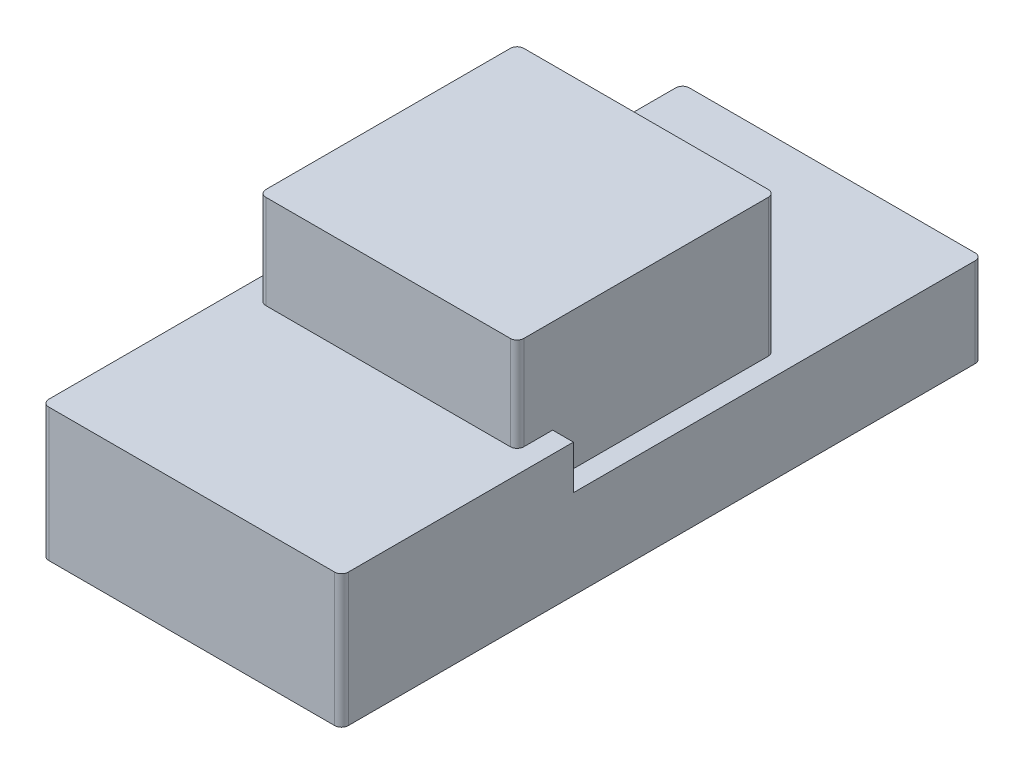
ISO-10303-21;
HEADER;
FILE_DESCRIPTION(('STEP AP214'),'2;1');
FILE_NAME('part.step','',(''),(''),'','','');
FILE_SCHEMA(('AUTOMOTIVE_DESIGN { 1 0 10303 214 1 1 1 1 }'));
ENDSEC;
DATA;
#1=APPLICATION_CONTEXT('core data for automotive mechanical design processes');
#2=APPLICATION_PROTOCOL_DEFINITION('international standard','automotive_design',2000,#1);
#3=PRODUCT_CONTEXT('',#1,'mechanical');
#4=PRODUCT('Part','Part','',(#3));
#5=PRODUCT_RELATED_PRODUCT_CATEGORY('part','',(#4));
#6=PRODUCT_DEFINITION_FORMATION('','',#4);
#7=PRODUCT_DEFINITION_CONTEXT('part definition',#1,'design');
#8=PRODUCT_DEFINITION('design','',#6,#7);
#9=PRODUCT_DEFINITION_SHAPE('','',#8);
#10=(LENGTH_UNIT() NAMED_UNIT(*) SI_UNIT(.MILLI.,.METRE.));
#11=(NAMED_UNIT(*) PLANE_ANGLE_UNIT() SI_UNIT($,.RADIAN.));
#12=(NAMED_UNIT(*) SI_UNIT($,.STERADIAN.) SOLID_ANGLE_UNIT());
#13=UNCERTAINTY_MEASURE_WITH_UNIT(LENGTH_MEASURE(1.E-05),#10,'distance_accuracy_value','');
#14=(GEOMETRIC_REPRESENTATION_CONTEXT(3) GLOBAL_UNCERTAINTY_ASSIGNED_CONTEXT((#13)) GLOBAL_UNIT_ASSIGNED_CONTEXT((#10,
#11,#12)) REPRESENTATION_CONTEXT('',''));
#15=CARTESIAN_POINT('',(0.,0.,0.));
#16=DIRECTION('',(0.,0.,1.));
#17=DIRECTION('',(1.,0.,0.));
#18=AXIS2_PLACEMENT_3D('',#15,#16,#17);
#19=CARTESIAN_POINT('',(-22.115,13.17,47.3));
#20=DIRECTION('',(1.,0.,0.));
#21=DIRECTION('',(0.,0.,-1.));
#22=AXIS2_PLACEMENT_3D('',#19,#20,#21);
#23=PLANE('',#22);
#24=DIRECTION('',(0.,0.,1.));
#25=VECTOR('',#24,1.);
#26=CARTESIAN_POINT('',(-22.115,0.,47.3));
#27=LINE('',#26,#25);
#28=CARTESIAN_POINT('',(-22.115,0.,-46.3));
#29=VERTEX_POINT('',#28);
#30=CARTESIAN_POINT('',(-22.115,0.,46.3));
#31=VERTEX_POINT('',#30);
#32=EDGE_CURVE('E275',#29,#31,#27,.T.);
#33=ORIENTED_EDGE('',*,*,#32,.T.);
#34=DIRECTION('',(0.,-1.,0.));
#35=VECTOR('',#34,1.);
#36=CARTESIAN_POINT('',(-22.115,13.17,46.3));
#37=LINE('',#36,#35);
#38=CARTESIAN_POINT('',(-22.115,19.64,46.3));
#39=VERTEX_POINT('',#38);
#40=EDGE_CURVE('E331',#31,#39,#37,.F.);
#41=ORIENTED_EDGE('',*,*,#40,.T.);
#42=DIRECTION('',(0.,0.,1.));
#43=VECTOR('',#42,1.);
#44=CARTESIAN_POINT('',(-22.115,19.64,0.));
#45=LINE('',#44,#43);
#46=CARTESIAN_POINT('',(-22.115,19.64,13.04351903894));
#47=VERTEX_POINT('',#46);
#48=EDGE_CURVE('E221',#47,#39,#45,.T.);
#49=ORIENTED_EDGE('',*,*,#48,.F.);
#50=DIRECTION('',(0.,-1.,0.));
#51=VECTOR('',#50,1.);
#52=CARTESIAN_POINT('',(-22.115,19.64,13.04351903894));
#53=LINE('',#52,#51);
#54=CARTESIAN_POINT('',(-22.115,13.17,13.04351903894));
#55=VERTEX_POINT('',#54);
#56=EDGE_CURVE('E250',#47,#55,#53,.T.);
#57=ORIENTED_EDGE('',*,*,#56,.T.);
#58=DIRECTION('',(0.,0.,1.));
#59=VECTOR('',#58,1.);
#60=CARTESIAN_POINT('',(-22.115,13.17,47.3));
#61=LINE('',#60,#59);
#62=CARTESIAN_POINT('',(-22.115,13.17,-46.3));
#63=VERTEX_POINT('',#62);
#64=EDGE_CURVE('E67',#63,#55,#61,.T.);
#65=ORIENTED_EDGE('',*,*,#64,.F.);
#66=DIRECTION('',(0.,-1.,0.));
#67=VECTOR('',#66,1.);
#68=CARTESIAN_POINT('',(-22.115,13.17,-46.3));
#69=LINE('',#68,#67);
#70=EDGE_CURVE('E327',#63,#29,#69,.T.);
#71=ORIENTED_EDGE('',*,*,#70,.T.);
#72=EDGE_LOOP('',(#33,#41,#49,#57,#65,#71));
#73=FACE_BOUND('',#72,.T.);
#74=ADVANCED_FACE('F44',(#73),#23,.F.);
#75=CARTESIAN_POINT('',(22.115,13.17,47.3));
#76=DIRECTION('',(0.,0.,-1.));
#77=DIRECTION('',(-1.,0.,0.));
#78=AXIS2_PLACEMENT_3D('',#75,#76,#77);
#79=PLANE('',#78);
#80=DIRECTION('',(0.,-1.,0.));
#81=VECTOR('',#80,1.);
#82=CARTESIAN_POINT('',(21.115,13.17,47.3));
#83=LINE('',#82,#81);
#84=CARTESIAN_POINT('',(21.115,0.,47.3));
#85=VERTEX_POINT('',#84);
#86=CARTESIAN_POINT('',(21.115,19.64,47.3));
#87=VERTEX_POINT('',#86);
#88=EDGE_CURVE('E294',#85,#87,#83,.F.);
#89=ORIENTED_EDGE('',*,*,#88,.T.);
#90=DIRECTION('',(1.,0.,0.));
#91=VECTOR('',#90,1.);
#92=CARTESIAN_POINT('',(0.,19.64,47.3));
#93=LINE('',#92,#91);
#94=CARTESIAN_POINT('',(-21.115,19.64,47.3));
#95=VERTEX_POINT('',#94);
#96=EDGE_CURVE('E229',#95,#87,#93,.T.);
#97=ORIENTED_EDGE('',*,*,#96,.F.);
#98=DIRECTION('',(0.,-1.,0.));
#99=VECTOR('',#98,1.);
#100=CARTESIAN_POINT('',(-21.115,13.17,47.3));
#101=LINE('',#100,#99);
#102=CARTESIAN_POINT('',(-21.115,0.,47.3));
#103=VERTEX_POINT('',#102);
#104=EDGE_CURVE('E311',#95,#103,#101,.T.);
#105=ORIENTED_EDGE('',*,*,#104,.T.);
#106=DIRECTION('',(1.,0.,0.));
#107=VECTOR('',#106,1.);
#108=CARTESIAN_POINT('',(22.115,0.,47.3));
#109=LINE('',#108,#107);
#110=EDGE_CURVE('E298',#103,#85,#109,.T.);
#111=ORIENTED_EDGE('',*,*,#110,.T.);
#112=EDGE_LOOP('',(#89,#97,#105,#111));
#113=FACE_BOUND('',#112,.T.);
#114=ADVANCED_FACE('F445',(#113),#79,.F.);
#115=CARTESIAN_POINT('',(22.115,13.17,47.3));
#116=DIRECTION('',(-1.,0.,0.));
#117=DIRECTION('',(0.,0.,1.));
#118=AXIS2_PLACEMENT_3D('',#115,#116,#117);
#119=PLANE('',#118);
#120=DIRECTION('',(0.,0.,-1.));
#121=VECTOR('',#120,1.);
#122=CARTESIAN_POINT('',(22.115,13.17,47.3));
#123=LINE('',#122,#121);
#124=CARTESIAN_POINT('',(22.115,13.17,13.04351903894));
#125=VERTEX_POINT('',#124);
#126=CARTESIAN_POINT('',(22.115,13.17,-46.3));
#127=VERTEX_POINT('',#126);
#128=EDGE_CURVE('E286',#125,#127,#123,.T.);
#129=ORIENTED_EDGE('',*,*,#128,.F.);
#130=DIRECTION('',(0.,-1.,0.));
#131=VECTOR('',#130,1.);
#132=CARTESIAN_POINT('',(22.115,19.64,13.04351903894));
#133=LINE('',#132,#131);
#134=CARTESIAN_POINT('',(22.115,19.64,13.04351903894));
#135=VERTEX_POINT('',#134);
#136=EDGE_CURVE('E240',#135,#125,#133,.T.);
#137=ORIENTED_EDGE('',*,*,#136,.F.);
#138=DIRECTION('',(0.,0.,-1.));
#139=VECTOR('',#138,1.);
#140=CARTESIAN_POINT('',(22.115,19.64,0.));
#141=LINE('',#140,#139);
#142=CARTESIAN_POINT('',(22.115,19.64,46.3));
#143=VERTEX_POINT('',#142);
#144=EDGE_CURVE('E237',#143,#135,#141,.T.);
#145=ORIENTED_EDGE('',*,*,#144,.F.);
#146=DIRECTION('',(0.,-1.,0.));
#147=VECTOR('',#146,1.);
#148=CARTESIAN_POINT('',(22.115,13.17,46.3));
#149=LINE('',#148,#147);
#150=CARTESIAN_POINT('',(22.115,0.,46.3));
#151=VERTEX_POINT('',#150);
#152=EDGE_CURVE('E344',#143,#151,#149,.T.);
#153=ORIENTED_EDGE('',*,*,#152,.T.);
#154=DIRECTION('',(0.,0.,-1.));
#155=VECTOR('',#154,1.);
#156=CARTESIAN_POINT('',(22.115,0.,47.3));
#157=LINE('',#156,#155);
#158=CARTESIAN_POINT('',(22.115,0.,-46.3));
#159=VERTEX_POINT('',#158);
#160=EDGE_CURVE('E302',#151,#159,#157,.T.);
#161=ORIENTED_EDGE('',*,*,#160,.T.);
#162=DIRECTION('',(0.,-1.,0.));
#163=VECTOR('',#162,1.);
#164=CARTESIAN_POINT('',(22.115,13.17,-46.3));
#165=LINE('',#164,#163);
#166=EDGE_CURVE('E340',#159,#127,#165,.F.);
#167=ORIENTED_EDGE('',*,*,#166,.T.);
#168=EDGE_LOOP('',(#129,#137,#145,#153,#161,#167));
#169=FACE_BOUND('',#168,.T.);
#170=ADVANCED_FACE('F422',(#169),#119,.F.);
#171=CARTESIAN_POINT('',(22.115,13.17,-47.3));
#172=DIRECTION('',(0.,0.,1.));
#173=DIRECTION('',(1.,0.,0.));
#174=AXIS2_PLACEMENT_3D('',#171,#172,#173);
#175=PLANE('',#174);
#176=DIRECTION('',(-1.,0.,0.));
#177=VECTOR('',#176,1.);
#178=CARTESIAN_POINT('',(22.115,13.17,-47.3));
#179=LINE('',#178,#177);
#180=CARTESIAN_POINT('',(21.115,13.17,-47.3));
#181=VERTEX_POINT('',#180);
#182=CARTESIAN_POINT('',(-21.115,13.17,-47.3));
#183=VERTEX_POINT('',#182);
#184=EDGE_CURVE('E290',#181,#183,#179,.T.);
#185=ORIENTED_EDGE('',*,*,#184,.F.);
#186=DIRECTION('',(0.,-1.,0.));
#187=VECTOR('',#186,1.);
#188=CARTESIAN_POINT('',(21.115,13.17,-47.3));
#189=LINE('',#188,#187);
#190=CARTESIAN_POINT('',(21.115,0.,-47.3));
#191=VERTEX_POINT('',#190);
#192=EDGE_CURVE('E384',#181,#191,#189,.T.);
#193=ORIENTED_EDGE('',*,*,#192,.T.);
#194=DIRECTION('',(-1.,0.,0.));
#195=VECTOR('',#194,1.);
#196=CARTESIAN_POINT('',(22.115,0.,-47.3));
#197=LINE('',#196,#195);
#198=CARTESIAN_POINT('',(-21.115,0.,-47.3));
#199=VERTEX_POINT('',#198);
#200=EDGE_CURVE('E287',#191,#199,#197,.T.);
#201=ORIENTED_EDGE('',*,*,#200,.T.);
#202=DIRECTION('',(0.,-1.,0.));
#203=VECTOR('',#202,1.);
#204=CARTESIAN_POINT('',(-21.115,13.17,-47.3));
#205=LINE('',#204,#203);
#206=EDGE_CURVE('E381',#199,#183,#205,.F.);
#207=ORIENTED_EDGE('',*,*,#206,.T.);
#208=EDGE_LOOP('',(#185,#193,#201,#207));
#209=FACE_BOUND('',#208,.T.);
#210=ADVANCED_FACE('F430',(#209),#175,.F.);
#211=CARTESIAN_POINT('',(0.,13.17,0.));
#212=DIRECTION('',(0.,1.,0.));
#213=DIRECTION('',(0.,0.,1.));
#214=AXIS2_PLACEMENT_3D('',#211,#212,#213);
#215=PLANE('',#214);
#216=DIRECTION('',(1.,0.,0.));
#217=VECTOR('',#216,1.);
#218=CARTESIAN_POINT('',(0.,13.17,13.04351903894));
#219=LINE('',#218,#217);
#220=CARTESIAN_POINT('',(19.05,13.17,13.04351903894));
#221=VERTEX_POINT('',#220);
#222=EDGE_CURVE('E60',#221,#125,#219,.T.);
#223=ORIENTED_EDGE('',*,*,#222,.T.);
#224=ORIENTED_EDGE('',*,*,#128,.T.);
#225=CARTESIAN_POINT('',(21.115,13.17,-46.3));
#226=DIRECTION('',(0.,1.,0.));
#227=DIRECTION('',(0.,0.,1.));
#228=AXIS2_PLACEMENT_3D('',#225,#226,#227);
#229=CIRCLE('',#228,1.);
#230=EDGE_CURVE('E337',#127,#181,#229,.T.);
#231=ORIENTED_EDGE('',*,*,#230,.T.);
#232=ORIENTED_EDGE('',*,*,#184,.T.);
#233=CARTESIAN_POINT('',(-21.115,13.17,-46.3));
#234=DIRECTION('',(0.,1.,0.));
#235=DIRECTION('',(0.,0.,1.));
#236=AXIS2_PLACEMENT_3D('',#233,#234,#235);
#237=CIRCLE('',#236,1.);
#238=EDGE_CURVE('E334',#183,#63,#237,.T.);
#239=ORIENTED_EDGE('',*,*,#238,.T.);
#240=ORIENTED_EDGE('',*,*,#64,.T.);
#241=DIRECTION('',(1.,0.,0.));
#242=VECTOR('',#241,1.);
#243=CARTESIAN_POINT('',(0.,13.17,13.04351903894));
#244=LINE('',#243,#242);
#245=CARTESIAN_POINT('',(-19.05,13.17,13.04351903894));
#246=VERTEX_POINT('',#245);
#247=EDGE_CURVE('E243',#55,#246,#244,.T.);
#248=ORIENTED_EDGE('',*,*,#247,.T.);
#249=DIRECTION('',(0.,0.,1.));
#250=VECTOR('',#249,1.);
#251=CARTESIAN_POINT('',(-19.05,13.17,18.3));
#252=LINE('',#251,#250);
#253=CARTESIAN_POINT('',(-19.05,13.17,-18.8));
#254=VERTEX_POINT('',#253);
#255=EDGE_CURVE('E258',#254,#246,#252,.T.);
#256=ORIENTED_EDGE('',*,*,#255,.F.);
#257=CARTESIAN_POINT('',(-18.05,13.17,-18.8));
#258=DIRECTION('',(0.,1.,0.));
#259=DIRECTION('',(0.,0.,1.));
#260=AXIS2_PLACEMENT_3D('',#257,#258,#259);
#261=CIRCLE('',#260,1.);
#262=CARTESIAN_POINT('',(-18.05,13.17,-19.8));
#263=VERTEX_POINT('',#262);
#264=EDGE_CURVE('E11',#254,#263,#261,.F.);
#265=ORIENTED_EDGE('',*,*,#264,.T.);
#266=DIRECTION('',(-1.,0.,0.));
#267=VECTOR('',#266,1.);
#268=CARTESIAN_POINT('',(19.05,13.17,-19.8));
#269=LINE('',#268,#267);
#270=CARTESIAN_POINT('',(18.05,13.17,-19.8));
#271=VERTEX_POINT('',#270);
#272=EDGE_CURVE('E263',#271,#263,#269,.T.);
#273=ORIENTED_EDGE('',*,*,#272,.F.);
#274=CARTESIAN_POINT('',(18.05,13.17,-18.8));
#275=DIRECTION('',(0.,1.,0.));
#276=DIRECTION('',(0.,0.,1.));
#277=AXIS2_PLACEMENT_3D('',#274,#275,#276);
#278=CIRCLE('',#277,1.);
#279=CARTESIAN_POINT('',(19.05,13.17,-18.8));
#280=VERTEX_POINT('',#279);
#281=EDGE_CURVE('E53',#271,#280,#278,.F.);
#282=ORIENTED_EDGE('',*,*,#281,.T.);
#283=DIRECTION('',(0.,0.,-1.));
#284=VECTOR('',#283,1.);
#285=CARTESIAN_POINT('',(19.05,13.17,18.3));
#286=LINE('',#285,#284);
#287=EDGE_CURVE('E278',#221,#280,#286,.T.);
#288=ORIENTED_EDGE('',*,*,#287,.F.);
#289=EDGE_LOOP('',(#223,#224,#231,#232,#239,#240,#248,#256,#265,#273,#282,#288));
#290=FACE_BOUND('',#289,.T.);
#291=ADVANCED_FACE('F391',(#290),#215,.T.);
#292=CARTESIAN_POINT('',(0.,0.,0.));
#293=DIRECTION('',(0.,1.,0.));
#294=DIRECTION('',(0.,0.,1.));
#295=AXIS2_PLACEMENT_3D('',#292,#293,#294);
#296=PLANE('',#295);
#297=ORIENTED_EDGE('',*,*,#110,.F.);
#298=CARTESIAN_POINT('',(-21.115,0.,46.3));
#299=DIRECTION('',(0.,1.,0.));
#300=DIRECTION('',(0.,0.,1.));
#301=AXIS2_PLACEMENT_3D('',#298,#299,#300);
#302=CIRCLE('',#301,1.);
#303=EDGE_CURVE('E324',#103,#31,#302,.F.);
#304=ORIENTED_EDGE('',*,*,#303,.T.);
#305=ORIENTED_EDGE('',*,*,#32,.F.);
#306=CARTESIAN_POINT('',(-21.115,0.,-46.3));
#307=DIRECTION('',(0.,1.,0.));
#308=DIRECTION('',(0.,0.,1.));
#309=AXIS2_PLACEMENT_3D('',#306,#307,#308);
#310=CIRCLE('',#309,1.);
#311=EDGE_CURVE('E315',#29,#199,#310,.F.);
#312=ORIENTED_EDGE('',*,*,#311,.T.);
#313=ORIENTED_EDGE('',*,*,#200,.F.);
#314=CARTESIAN_POINT('',(21.115,0.,-46.3));
#315=DIRECTION('',(0.,1.,0.));
#316=DIRECTION('',(0.,0.,1.));
#317=AXIS2_PLACEMENT_3D('',#314,#315,#316);
#318=CIRCLE('',#317,1.);
#319=EDGE_CURVE('E318',#191,#159,#318,.F.);
#320=ORIENTED_EDGE('',*,*,#319,.T.);
#321=ORIENTED_EDGE('',*,*,#160,.F.);
#322=CARTESIAN_POINT('',(21.115,0.,46.3));
#323=DIRECTION('',(0.,1.,0.));
#324=DIRECTION('',(0.,0.,1.));
#325=AXIS2_PLACEMENT_3D('',#322,#323,#324);
#326=CIRCLE('',#325,1.);
#327=EDGE_CURVE('E321',#151,#85,#326,.F.);
#328=ORIENTED_EDGE('',*,*,#327,.T.);
#329=EDGE_LOOP('',(#297,#304,#305,#312,#313,#320,#321,#328));
#330=FACE_BOUND('',#329,.T.);
#331=ADVANCED_FACE('F437',(#330),#296,.F.);
#332=CARTESIAN_POINT('',(-19.05,33.5,18.3));
#333=DIRECTION('',(1.,0.,0.));
#334=DIRECTION('',(0.,0.,-1.));
#335=AXIS2_PLACEMENT_3D('',#332,#333,#334);
#336=PLANE('',#335);
#337=ORIENTED_EDGE('',*,*,#255,.T.);
#338=DIRECTION('',(0.,-1.,0.));
#339=VECTOR('',#338,1.);
#340=CARTESIAN_POINT('',(-19.05,19.64,13.04351903894));
#341=LINE('',#340,#339);
#342=CARTESIAN_POINT('',(-19.05,19.64,13.04351903894));
#343=VERTEX_POINT('',#342);
#344=EDGE_CURVE('E200',#343,#246,#341,.T.);
#345=ORIENTED_EDGE('',*,*,#344,.F.);
#346=DIRECTION('',(0.,0.,-1.));
#347=VECTOR('',#346,1.);
#348=CARTESIAN_POINT('',(-19.05,19.64,0.));
#349=LINE('',#348,#347);
#350=CARTESIAN_POINT('',(-19.05,19.64,17.3));
#351=VERTEX_POINT('',#350);
#352=EDGE_CURVE('E196',#351,#343,#349,.T.);
#353=ORIENTED_EDGE('',*,*,#352,.F.);
#354=DIRECTION('',(0.,-1.,0.));
#355=VECTOR('',#354,1.);
#356=CARTESIAN_POINT('',(-19.05,33.5,17.3));
#357=LINE('',#356,#355);
#358=CARTESIAN_POINT('',(-19.05,33.5,17.3));
#359=VERTEX_POINT('',#358);
#360=EDGE_CURVE('E180',#351,#359,#357,.F.);
#361=ORIENTED_EDGE('',*,*,#360,.T.);
#362=DIRECTION('',(0.,0.,1.));
#363=VECTOR('',#362,1.);
#364=CARTESIAN_POINT('',(-19.05,33.5,18.3));
#365=LINE('',#364,#363);
#366=CARTESIAN_POINT('',(-19.05,33.5,-18.8));
#367=VERTEX_POINT('',#366);
#368=EDGE_CURVE('E259',#367,#359,#365,.T.);
#369=ORIENTED_EDGE('',*,*,#368,.F.);
#370=DIRECTION('',(0.,-1.,0.));
#371=VECTOR('',#370,1.);
#372=CARTESIAN_POINT('',(-19.05,33.5,-18.8));
#373=LINE('',#372,#371);
#374=EDGE_CURVE('E193',#367,#254,#373,.T.);
#375=ORIENTED_EDGE('',*,*,#374,.T.);
#376=EDGE_LOOP('',(#337,#345,#353,#361,#369,#375));
#377=FACE_BOUND('',#376,.T.);
#378=ADVANCED_FACE('F198',(#377),#336,.F.);
#379=CARTESIAN_POINT('',(19.05,33.5,18.3));
#380=DIRECTION('',(0.,0.,-1.));
#381=DIRECTION('',(-1.,0.,0.));
#382=AXIS2_PLACEMENT_3D('',#379,#380,#381);
#383=PLANE('',#382);
#384=DIRECTION('',(0.,-1.,0.));
#385=VECTOR('',#384,1.);
#386=CARTESIAN_POINT('',(-18.05,33.5,18.3));
#387=LINE('',#386,#385);
#388=CARTESIAN_POINT('',(-18.05,33.5,18.3));
#389=VERTEX_POINT('',#388);
#390=CARTESIAN_POINT('',(-18.05,19.64,18.3));
#391=VERTEX_POINT('',#390);
#392=EDGE_CURVE('E355',#389,#391,#387,.T.);
#393=ORIENTED_EDGE('',*,*,#392,.T.);
#394=DIRECTION('',(-1.,0.,0.));
#395=VECTOR('',#394,1.);
#396=CARTESIAN_POINT('',(0.,19.64,18.3));
#397=LINE('',#396,#395);
#398=CARTESIAN_POINT('',(18.05,19.64,18.3));
#399=VERTEX_POINT('',#398);
#400=EDGE_CURVE('E211',#399,#391,#397,.T.);
#401=ORIENTED_EDGE('',*,*,#400,.F.);
#402=DIRECTION('',(0.,-1.,0.));
#403=VECTOR('',#402,1.);
#404=CARTESIAN_POINT('',(18.05,33.5,18.3));
#405=LINE('',#404,#403);
#406=CARTESIAN_POINT('',(18.05,33.5,18.3));
#407=VERTEX_POINT('',#406);
#408=EDGE_CURVE('E358',#399,#407,#405,.F.);
#409=ORIENTED_EDGE('',*,*,#408,.T.);
#410=DIRECTION('',(1.,0.,0.));
#411=VECTOR('',#410,1.);
#412=CARTESIAN_POINT('',(19.05,33.5,18.3));
#413=LINE('',#412,#411);
#414=EDGE_CURVE('E262',#389,#407,#413,.T.);
#415=ORIENTED_EDGE('',*,*,#414,.F.);
#416=EDGE_LOOP('',(#393,#401,#409,#415));
#417=FACE_BOUND('',#416,.T.);
#418=ADVANCED_FACE('F479',(#417),#383,.F.);
#419=CARTESIAN_POINT('',(19.05,33.5,18.3));
#420=DIRECTION('',(-1.,0.,0.));
#421=DIRECTION('',(0.,0.,1.));
#422=AXIS2_PLACEMENT_3D('',#419,#420,#421);
#423=PLANE('',#422);
#424=DIRECTION('',(0.,0.,1.));
#425=VECTOR('',#424,1.);
#426=CARTESIAN_POINT('',(19.05,19.64,0.));
#427=LINE('',#426,#425);
#428=CARTESIAN_POINT('',(19.05,19.64,13.04351903894));
#429=VERTEX_POINT('',#428);
#430=CARTESIAN_POINT('',(19.05,19.64,17.3));
#431=VERTEX_POINT('',#430);
#432=EDGE_CURVE('E409',#429,#431,#427,.T.);
#433=ORIENTED_EDGE('',*,*,#432,.F.);
#434=DIRECTION('',(0.,-1.,0.));
#435=VECTOR('',#434,1.);
#436=CARTESIAN_POINT('',(19.05,19.64,13.04351903894));
#437=LINE('',#436,#435);
#438=EDGE_CURVE('E255',#429,#221,#437,.T.);
#439=ORIENTED_EDGE('',*,*,#438,.T.);
#440=ORIENTED_EDGE('',*,*,#287,.T.);
#441=DIRECTION('',(0.,-1.,0.));
#442=VECTOR('',#441,1.);
#443=CARTESIAN_POINT('',(19.05,33.5,-18.8));
#444=LINE('',#443,#442);
#445=CARTESIAN_POINT('',(19.05,33.5,-18.8));
#446=VERTEX_POINT('',#445);
#447=EDGE_CURVE('E348',#280,#446,#444,.F.);
#448=ORIENTED_EDGE('',*,*,#447,.T.);
#449=DIRECTION('',(0.,0.,-1.));
#450=VECTOR('',#449,1.);
#451=CARTESIAN_POINT('',(19.05,33.5,18.3));
#452=LINE('',#451,#450);
#453=CARTESIAN_POINT('',(19.05,33.5,17.3));
#454=VERTEX_POINT('',#453);
#455=EDGE_CURVE('E267',#454,#446,#452,.T.);
#456=ORIENTED_EDGE('',*,*,#455,.F.);
#457=DIRECTION('',(0.,-1.,0.));
#458=VECTOR('',#457,1.);
#459=CARTESIAN_POINT('',(19.05,33.5,17.3));
#460=LINE('',#459,#458);
#461=EDGE_CURVE('E351',#454,#431,#460,.T.);
#462=ORIENTED_EDGE('',*,*,#461,.T.);
#463=EDGE_LOOP('',(#433,#439,#440,#448,#456,#462));
#464=FACE_BOUND('',#463,.T.);
#465=ADVANCED_FACE('F398',(#464),#423,.F.);
#466=CARTESIAN_POINT('',(19.05,33.5,-19.8));
#467=DIRECTION('',(0.,0.,1.));
#468=DIRECTION('',(1.,0.,0.));
#469=AXIS2_PLACEMENT_3D('',#466,#467,#468);
#470=PLANE('',#469);
#471=DIRECTION('',(-1.,0.,0.));
#472=VECTOR('',#471,1.);
#473=CARTESIAN_POINT('',(19.05,33.5,-19.8));
#474=LINE('',#473,#472);
#475=CARTESIAN_POINT('',(18.05,33.5,-19.8));
#476=VERTEX_POINT('',#475);
#477=CARTESIAN_POINT('',(-18.05,33.5,-19.8));
#478=VERTEX_POINT('',#477);
#479=EDGE_CURVE('E271',#476,#478,#474,.T.);
#480=ORIENTED_EDGE('',*,*,#479,.F.);
#481=DIRECTION('',(0.,-1.,0.));
#482=VECTOR('',#481,1.);
#483=CARTESIAN_POINT('',(18.05,33.5,-19.8));
#484=LINE('',#483,#482);
#485=EDGE_CURVE('E377',#476,#271,#484,.T.);
#486=ORIENTED_EDGE('',*,*,#485,.T.);
#487=ORIENTED_EDGE('',*,*,#272,.T.);
#488=DIRECTION('',(0.,-1.,0.));
#489=VECTOR('',#488,1.);
#490=CARTESIAN_POINT('',(-18.05,33.5,-19.8));
#491=LINE('',#490,#489);
#492=EDGE_CURVE('E192',#263,#478,#491,.F.);
#493=ORIENTED_EDGE('',*,*,#492,.T.);
#494=EDGE_LOOP('',(#480,#486,#487,#493));
#495=FACE_BOUND('',#494,.T.);
#496=ADVANCED_FACE('F460',(#495),#470,.F.);
#497=CARTESIAN_POINT('',(0.,33.5,0.));
#498=DIRECTION('',(0.,1.,0.));
#499=DIRECTION('',(0.,0.,1.));
#500=AXIS2_PLACEMENT_3D('',#497,#498,#499);
#501=PLANE('',#500);
#502=ORIENTED_EDGE('',*,*,#414,.T.);
#503=CARTESIAN_POINT('',(18.05,33.5,17.3));
#504=DIRECTION('',(0.,1.,0.));
#505=DIRECTION('',(0.,0.,1.));
#506=AXIS2_PLACEMENT_3D('',#503,#504,#505);
#507=CIRCLE('',#506,1.);
#508=EDGE_CURVE('E369',#407,#454,#507,.T.);
#509=ORIENTED_EDGE('',*,*,#508,.T.);
#510=ORIENTED_EDGE('',*,*,#455,.T.);
#511=CARTESIAN_POINT('',(18.05,33.5,-18.8));
#512=DIRECTION('',(0.,1.,0.));
#513=DIRECTION('',(0.,0.,1.));
#514=AXIS2_PLACEMENT_3D('',#511,#512,#513);
#515=CIRCLE('',#514,1.);
#516=EDGE_CURVE('E364',#446,#476,#515,.T.);
#517=ORIENTED_EDGE('',*,*,#516,.T.);
#518=ORIENTED_EDGE('',*,*,#479,.T.);
#519=CARTESIAN_POINT('',(-18.05,33.5,-18.8));
#520=DIRECTION('',(0.,1.,0.));
#521=DIRECTION('',(0.,0.,1.));
#522=AXIS2_PLACEMENT_3D('',#519,#520,#521);
#523=CIRCLE('',#522,1.);
#524=EDGE_CURVE('E361',#478,#367,#523,.T.);
#525=ORIENTED_EDGE('',*,*,#524,.T.);
#526=ORIENTED_EDGE('',*,*,#368,.T.);
#527=CARTESIAN_POINT('',(-18.05,33.5,17.3));
#528=DIRECTION('',(0.,1.,0.));
#529=DIRECTION('',(0.,0.,1.));
#530=AXIS2_PLACEMENT_3D('',#527,#528,#529);
#531=CIRCLE('',#530,1.);
#532=EDGE_CURVE('E187',#359,#389,#531,.T.);
#533=ORIENTED_EDGE('',*,*,#532,.T.);
#534=EDGE_LOOP('',(#502,#509,#510,#517,#518,#525,#526,#533));
#535=FACE_BOUND('',#534,.T.);
#536=ADVANCED_FACE('F401',(#535),#501,.T.);
#537=CARTESIAN_POINT('',(-21.115,13.17,46.3));
#538=DIRECTION('',(0.,-1.,0.));
#539=DIRECTION('',(0.,0.,-1.));
#540=AXIS2_PLACEMENT_3D('',#537,#538,#539);
#541=CYLINDRICAL_SURFACE('',#540,1.);
#542=ORIENTED_EDGE('',*,*,#104,.F.);
#543=CARTESIAN_POINT('',(-21.115,19.64,46.3));
#544=DIRECTION('',(0.,1.,0.));
#545=DIRECTION('',(0.,0.,1.));
#546=AXIS2_PLACEMENT_3D('',#543,#544,#545);
#547=CIRCLE('',#546,1.);
#548=EDGE_CURVE('E225',#39,#95,#547,.T.);
#549=ORIENTED_EDGE('',*,*,#548,.F.);
#550=ORIENTED_EDGE('',*,*,#40,.F.);
#551=ORIENTED_EDGE('',*,*,#303,.F.);
#552=EDGE_LOOP('',(#542,#549,#550,#551));
#553=FACE_BOUND('',#552,.T.);
#554=ADVANCED_FACE('F452',(#553),#541,.T.);
#555=CARTESIAN_POINT('',(21.115,13.17,46.3));
#556=DIRECTION('',(0.,-1.,0.));
#557=DIRECTION('',(0.,0.,-1.));
#558=AXIS2_PLACEMENT_3D('',#555,#556,#557);
#559=CYLINDRICAL_SURFACE('',#558,1.);
#560=ORIENTED_EDGE('',*,*,#152,.F.);
#561=CARTESIAN_POINT('',(21.115,19.64,46.3));
#562=DIRECTION('',(0.,1.,0.));
#563=DIRECTION('',(0.,0.,1.));
#564=AXIS2_PLACEMENT_3D('',#561,#562,#563);
#565=CIRCLE('',#564,1.);
#566=EDGE_CURVE('E233',#87,#143,#565,.T.);
#567=ORIENTED_EDGE('',*,*,#566,.F.);
#568=ORIENTED_EDGE('',*,*,#88,.F.);
#569=ORIENTED_EDGE('',*,*,#327,.F.);
#570=EDGE_LOOP('',(#560,#567,#568,#569));
#571=FACE_BOUND('',#570,.T.);
#572=ADVANCED_FACE('F440',(#571),#559,.T.);
#573=CARTESIAN_POINT('',(18.05,33.5,17.3));
#574=DIRECTION('',(0.,-1.,0.));
#575=DIRECTION('',(0.,0.,-1.));
#576=AXIS2_PLACEMENT_3D('',#573,#574,#575);
#577=CYLINDRICAL_SURFACE('',#576,1.);
#578=CARTESIAN_POINT('',(18.05,19.64,17.3));
#579=DIRECTION('',(0.,1.,0.));
#580=DIRECTION('',(0.,0.,1.));
#581=AXIS2_PLACEMENT_3D('',#578,#579,#580);
#582=CIRCLE('',#581,1.);
#583=EDGE_CURVE('E215',#431,#399,#582,.F.);
#584=ORIENTED_EDGE('',*,*,#583,.F.);
#585=ORIENTED_EDGE('',*,*,#461,.F.);
#586=ORIENTED_EDGE('',*,*,#508,.F.);
#587=ORIENTED_EDGE('',*,*,#408,.F.);
#588=EDGE_LOOP('',(#584,#585,#586,#587));
#589=FACE_BOUND('',#588,.T.);
#590=ADVANCED_FACE('F407',(#589),#577,.T.);
#591=CARTESIAN_POINT('',(-18.05,33.5,17.3));
#592=DIRECTION('',(0.,-1.,0.));
#593=DIRECTION('',(0.,0.,-1.));
#594=AXIS2_PLACEMENT_3D('',#591,#592,#593);
#595=CYLINDRICAL_SURFACE('',#594,1.);
#596=CARTESIAN_POINT('',(-18.05,19.64,17.3));
#597=DIRECTION('',(0.,1.,0.));
#598=DIRECTION('',(0.,0.,1.));
#599=AXIS2_PLACEMENT_3D('',#596,#597,#598);
#600=CIRCLE('',#599,1.);
#601=EDGE_CURVE('E185',#391,#351,#600,.F.);
#602=ORIENTED_EDGE('',*,*,#601,.F.);
#603=ORIENTED_EDGE('',*,*,#392,.F.);
#604=ORIENTED_EDGE('',*,*,#532,.F.);
#605=ORIENTED_EDGE('',*,*,#360,.F.);
#606=EDGE_LOOP('',(#602,#603,#604,#605));
#607=FACE_BOUND('',#606,.T.);
#608=ADVANCED_FACE('F182',(#607),#595,.T.);
#609=CARTESIAN_POINT('',(18.05,33.5,-18.8));
#610=DIRECTION('',(0.,-1.,0.));
#611=DIRECTION('',(0.,0.,-1.));
#612=AXIS2_PLACEMENT_3D('',#609,#610,#611);
#613=CYLINDRICAL_SURFACE('',#612,1.);
#614=ORIENTED_EDGE('',*,*,#516,.F.);
#615=ORIENTED_EDGE('',*,*,#447,.F.);
#616=ORIENTED_EDGE('',*,*,#281,.F.);
#617=ORIENTED_EDGE('',*,*,#485,.F.);
#618=EDGE_LOOP('',(#614,#615,#616,#617));
#619=FACE_BOUND('',#618,.T.);
#620=ADVANCED_FACE('F395',(#619),#613,.T.);
#621=CARTESIAN_POINT('',(-18.05,33.5,-18.8));
#622=DIRECTION('',(0.,-1.,0.));
#623=DIRECTION('',(0.,0.,-1.));
#624=AXIS2_PLACEMENT_3D('',#621,#622,#623);
#625=CYLINDRICAL_SURFACE('',#624,1.);
#626=ORIENTED_EDGE('',*,*,#524,.F.);
#627=ORIENTED_EDGE('',*,*,#492,.F.);
#628=ORIENTED_EDGE('',*,*,#264,.F.);
#629=ORIENTED_EDGE('',*,*,#374,.F.);
#630=EDGE_LOOP('',(#626,#627,#628,#629));
#631=FACE_BOUND('',#630,.T.);
#632=ADVANCED_FACE('F520',(#631),#625,.T.);
#633=CARTESIAN_POINT('',(21.115,13.17,-46.3));
#634=DIRECTION('',(0.,-1.,0.));
#635=DIRECTION('',(0.,0.,-1.));
#636=AXIS2_PLACEMENT_3D('',#633,#634,#635);
#637=CYLINDRICAL_SURFACE('',#636,1.);
#638=ORIENTED_EDGE('',*,*,#230,.F.);
#639=ORIENTED_EDGE('',*,*,#166,.F.);
#640=ORIENTED_EDGE('',*,*,#319,.F.);
#641=ORIENTED_EDGE('',*,*,#192,.F.);
#642=EDGE_LOOP('',(#638,#639,#640,#641));
#643=FACE_BOUND('',#642,.T.);
#644=ADVANCED_FACE('F433',(#643),#637,.T.);
#645=CARTESIAN_POINT('',(-21.115,13.17,-46.3));
#646=DIRECTION('',(0.,-1.,0.));
#647=DIRECTION('',(0.,0.,-1.));
#648=AXIS2_PLACEMENT_3D('',#645,#646,#647);
#649=CYLINDRICAL_SURFACE('',#648,1.);
#650=ORIENTED_EDGE('',*,*,#238,.F.);
#651=ORIENTED_EDGE('',*,*,#206,.F.);
#652=ORIENTED_EDGE('',*,*,#311,.F.);
#653=ORIENTED_EDGE('',*,*,#70,.F.);
#654=EDGE_LOOP('',(#650,#651,#652,#653));
#655=FACE_BOUND('',#654,.T.);
#656=ADVANCED_FACE('F46',(#655),#649,.T.);
#657=CARTESIAN_POINT('',(0.,19.64,13.04351903894));
#658=DIRECTION('',(0.,0.,-1.));
#659=DIRECTION('',(-1.,0.,0.));
#660=AXIS2_PLACEMENT_3D('',#657,#658,#659);
#661=PLANE('',#660);
#662=ORIENTED_EDGE('',*,*,#222,.F.);
#663=ORIENTED_EDGE('',*,*,#438,.F.);
#664=DIRECTION('',(1.,0.,0.));
#665=VECTOR('',#664,1.);
#666=CARTESIAN_POINT('',(0.,19.64,13.04351903894));
#667=LINE('',#666,#665);
#668=EDGE_CURVE('E246',#429,#135,#667,.T.);
#669=ORIENTED_EDGE('',*,*,#668,.T.);
#670=ORIENTED_EDGE('',*,*,#136,.T.);
#671=EDGE_LOOP('',(#662,#663,#669,#670));
#672=FACE_BOUND('',#671,.T.);
#673=ADVANCED_FACE('F418',(#672),#661,.T.);
#674=CARTESIAN_POINT('',(0.,19.64,13.04351903894));
#675=DIRECTION('',(0.,0.,-1.));
#676=DIRECTION('',(-1.,0.,0.));
#677=AXIS2_PLACEMENT_3D('',#674,#675,#676);
#678=PLANE('',#677);
#679=ORIENTED_EDGE('',*,*,#247,.F.);
#680=ORIENTED_EDGE('',*,*,#56,.F.);
#681=DIRECTION('',(1.,0.,0.));
#682=VECTOR('',#681,1.);
#683=CARTESIAN_POINT('',(0.,19.64,13.04351903894));
#684=LINE('',#683,#682);
#685=EDGE_CURVE('E205',#47,#343,#684,.T.);
#686=ORIENTED_EDGE('',*,*,#685,.T.);
#687=ORIENTED_EDGE('',*,*,#344,.T.);
#688=EDGE_LOOP('',(#679,#680,#686,#687));
#689=FACE_BOUND('',#688,.T.);
#690=ADVANCED_FACE('F490',(#689),#678,.T.);
#691=CARTESIAN_POINT('',(0.,19.64,0.));
#692=DIRECTION('',(0.,1.,0.));
#693=DIRECTION('',(0.,0.,1.));
#694=AXIS2_PLACEMENT_3D('',#691,#692,#693);
#695=PLANE('',#694);
#696=ORIENTED_EDGE('',*,*,#668,.F.);
#697=ORIENTED_EDGE('',*,*,#432,.T.);
#698=ORIENTED_EDGE('',*,*,#583,.T.);
#699=ORIENTED_EDGE('',*,*,#400,.T.);
#700=ORIENTED_EDGE('',*,*,#601,.T.);
#701=ORIENTED_EDGE('',*,*,#352,.T.);
#702=ORIENTED_EDGE('',*,*,#685,.F.);
#703=ORIENTED_EDGE('',*,*,#48,.T.);
#704=ORIENTED_EDGE('',*,*,#548,.T.);
#705=ORIENTED_EDGE('',*,*,#96,.T.);
#706=ORIENTED_EDGE('',*,*,#566,.T.);
#707=ORIENTED_EDGE('',*,*,#144,.T.);
#708=EDGE_LOOP('',(#696,#697,#698,#699,#700,#701,#702,#703,#704,#705,#706,#707));
#709=FACE_BOUND('',#708,.T.);
#710=ADVANCED_FACE('F209',(#709),#695,.T.);
#711=CLOSED_SHELL('',(#74,#114,#170,#210,#291,#331,#378,#418,#465,#496,#536,#554,#572,#590,#608,
#620,#632,#644,#656,#673,#690,#710));
#712=MANIFOLD_SOLID_BREP('B2',#711);
#713=ADVANCED_BREP_SHAPE_REPRESENTATION('',(#18,#712),#14);
#714=SHAPE_DEFINITION_REPRESENTATION(#9,#713);
ENDSEC;
END-ISO-10303-21;
